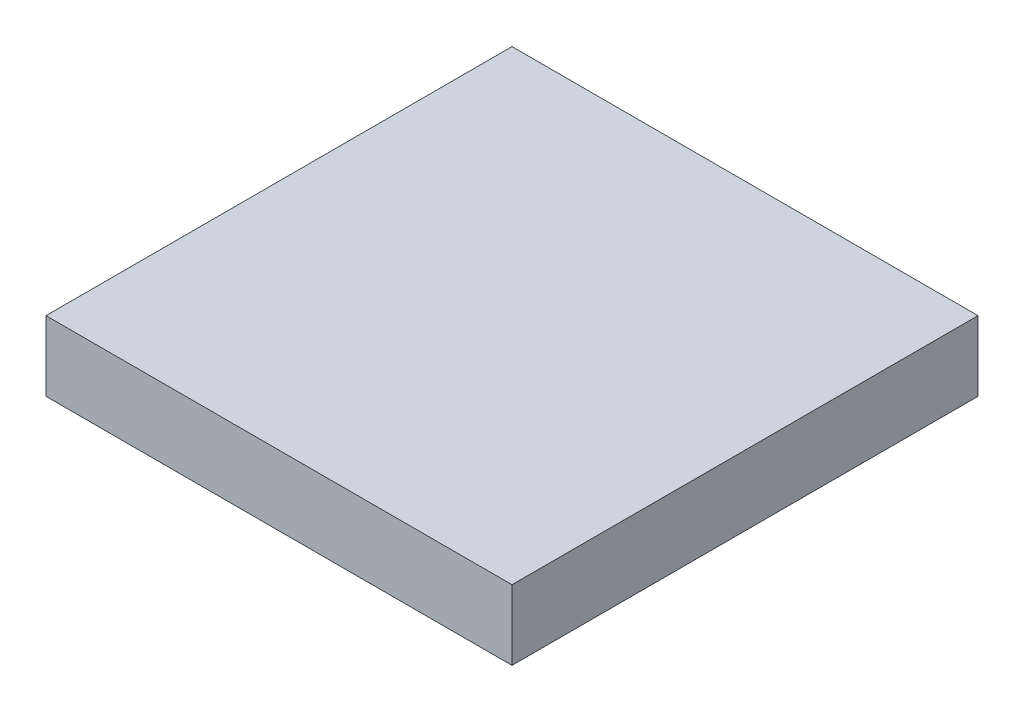
ISO-10303-21;
HEADER;
FILE_DESCRIPTION(('STEP AP214'),'2;1');
FILE_NAME('part.step','',(''),(''),'','','');
FILE_SCHEMA(('AUTOMOTIVE_DESIGN { 1 0 10303 214 1 1 1 1 }'));
ENDSEC;
DATA;
#1=APPLICATION_CONTEXT('core data for automotive mechanical design processes');
#2=APPLICATION_PROTOCOL_DEFINITION('international standard','automotive_design',2000,#1);
#3=PRODUCT_CONTEXT('',#1,'mechanical');
#4=PRODUCT('Part','Part','',(#3));
#5=PRODUCT_RELATED_PRODUCT_CATEGORY('part','',(#4));
#6=PRODUCT_DEFINITION_FORMATION('','',#4);
#7=PRODUCT_DEFINITION_CONTEXT('part definition',#1,'design');
#8=PRODUCT_DEFINITION('design','',#6,#7);
#9=PRODUCT_DEFINITION_SHAPE('','',#8);
#10=(LENGTH_UNIT() NAMED_UNIT(*) SI_UNIT(.MILLI.,.METRE.));
#11=(NAMED_UNIT(*) PLANE_ANGLE_UNIT() SI_UNIT($,.RADIAN.));
#12=(NAMED_UNIT(*) SI_UNIT($,.STERADIAN.) SOLID_ANGLE_UNIT());
#13=UNCERTAINTY_MEASURE_WITH_UNIT(LENGTH_MEASURE(1.E-05),#10,'distance_accuracy_value','');
#14=(GEOMETRIC_REPRESENTATION_CONTEXT(3) GLOBAL_UNCERTAINTY_ASSIGNED_CONTEXT((#13)) GLOBAL_UNIT_ASSIGNED_CONTEXT((#10,
#11,#12)) REPRESENTATION_CONTEXT('',''));
#15=CARTESIAN_POINT('',(0.,0.,0.));
#16=DIRECTION('',(0.,0.,1.));
#17=DIRECTION('',(1.,0.,0.));
#18=AXIS2_PLACEMENT_3D('',#15,#16,#17);
#19=CARTESIAN_POINT('',(0.,15.,0.));
#20=DIRECTION('',(1.,0.,0.));
#21=DIRECTION('',(0.,0.,-1.));
#22=AXIS2_PLACEMENT_3D('',#19,#20,#21);
#23=PLANE('',#22);
#24=DIRECTION('',(0.,0.,1.));
#25=VECTOR('',#24,1.);
#26=CARTESIAN_POINT('',(0.,0.,0.));
#27=LINE('',#26,#25);
#28=CARTESIAN_POINT('',(0.,0.,-100.));
#29=VERTEX_POINT('',#28);
#30=CARTESIAN_POINT('',(0.,0.,0.));
#31=VERTEX_POINT('',#30);
#32=EDGE_CURVE('E107',#29,#31,#27,.T.);
#33=ORIENTED_EDGE('',*,*,#32,.T.);
#34=DIRECTION('',(0.,-1.,0.));
#35=VECTOR('',#34,1.);
#36=CARTESIAN_POINT('',(0.,15.,0.));
#37=LINE('',#36,#35);
#38=CARTESIAN_POINT('',(0.,15.,0.));
#39=VERTEX_POINT('',#38);
#40=EDGE_CURVE('E11',#39,#31,#37,.T.);
#41=ORIENTED_EDGE('',*,*,#40,.F.);
#42=DIRECTION('',(0.,0.,1.));
#43=VECTOR('',#42,1.);
#44=CARTESIAN_POINT('',(0.,15.,0.));
#45=LINE('',#44,#43);
#46=CARTESIAN_POINT('',(0.,15.,-100.));
#47=VERTEX_POINT('',#46);
#48=EDGE_CURVE('E95',#47,#39,#45,.T.);
#49=ORIENTED_EDGE('',*,*,#48,.F.);
#50=DIRECTION('',(0.,-1.,0.));
#51=VECTOR('',#50,1.);
#52=CARTESIAN_POINT('',(0.,15.,-100.));
#53=LINE('',#52,#51);
#54=EDGE_CURVE('E103',#47,#29,#53,.T.);
#55=ORIENTED_EDGE('',*,*,#54,.T.);
#56=EDGE_LOOP('',(#33,#41,#49,#55));
#57=FACE_BOUND('',#56,.T.);
#58=ADVANCED_FACE('F44',(#57),#23,.F.);
#59=CARTESIAN_POINT('',(0.,15.,0.));
#60=DIRECTION('',(0.,0.,-1.));
#61=DIRECTION('',(-1.,0.,0.));
#62=AXIS2_PLACEMENT_3D('',#59,#60,#61);
#63=PLANE('',#62);
#64=DIRECTION('',(1.,0.,0.));
#65=VECTOR('',#64,1.);
#66=CARTESIAN_POINT('',(0.,0.,0.));
#67=LINE('',#66,#65);
#68=CARTESIAN_POINT('',(100.,0.,0.));
#69=VERTEX_POINT('',#68);
#70=EDGE_CURVE('E99',#31,#69,#67,.T.);
#71=ORIENTED_EDGE('',*,*,#70,.T.);
#72=DIRECTION('',(0.,-1.,0.));
#73=VECTOR('',#72,1.);
#74=CARTESIAN_POINT('',(100.,15.,0.));
#75=LINE('',#74,#73);
#76=CARTESIAN_POINT('',(100.,15.,0.));
#77=VERTEX_POINT('',#76);
#78=EDGE_CURVE('E52',#77,#69,#75,.T.);
#79=ORIENTED_EDGE('',*,*,#78,.F.);
#80=DIRECTION('',(1.,0.,0.));
#81=VECTOR('',#80,1.);
#82=CARTESIAN_POINT('',(0.,15.,0.));
#83=LINE('',#82,#81);
#84=EDGE_CURVE('E90',#39,#77,#83,.T.);
#85=ORIENTED_EDGE('',*,*,#84,.F.);
#86=ORIENTED_EDGE('',*,*,#40,.T.);
#87=EDGE_LOOP('',(#71,#79,#85,#86));
#88=FACE_BOUND('',#87,.T.);
#89=ADVANCED_FACE('F98',(#88),#63,.F.);
#90=CARTESIAN_POINT('',(100.,15.,0.));
#91=DIRECTION('',(-1.,0.,0.));
#92=DIRECTION('',(0.,0.,1.));
#93=AXIS2_PLACEMENT_3D('',#90,#91,#92);
#94=PLANE('',#93);
#95=DIRECTION('',(0.,0.,-1.));
#96=VECTOR('',#95,1.);
#97=CARTESIAN_POINT('',(100.,0.,0.));
#98=LINE('',#97,#96);
#99=CARTESIAN_POINT('',(100.,0.,-100.));
#100=VERTEX_POINT('',#99);
#101=EDGE_CURVE('E77',#69,#100,#98,.T.);
#102=ORIENTED_EDGE('',*,*,#101,.T.);
#103=DIRECTION('',(0.,-1.,0.));
#104=VECTOR('',#103,1.);
#105=CARTESIAN_POINT('',(100.,15.,-100.));
#106=LINE('',#105,#104);
#107=CARTESIAN_POINT('',(100.,15.,-100.));
#108=VERTEX_POINT('',#107);
#109=EDGE_CURVE('E100',#108,#100,#106,.T.);
#110=ORIENTED_EDGE('',*,*,#109,.F.);
#111=DIRECTION('',(0.,0.,-1.));
#112=VECTOR('',#111,1.);
#113=CARTESIAN_POINT('',(100.,15.,0.));
#114=LINE('',#113,#112);
#115=EDGE_CURVE('E93',#77,#108,#114,.T.);
#116=ORIENTED_EDGE('',*,*,#115,.F.);
#117=ORIENTED_EDGE('',*,*,#78,.T.);
#118=EDGE_LOOP('',(#102,#110,#116,#117));
#119=FACE_BOUND('',#118,.T.);
#120=ADVANCED_FACE('F101',(#119),#94,.F.);
#121=CARTESIAN_POINT('',(0.,15.,-100.));
#122=DIRECTION('',(0.,0.,1.));
#123=DIRECTION('',(1.,0.,0.));
#124=AXIS2_PLACEMENT_3D('',#121,#122,#123);
#125=PLANE('',#124);
#126=DIRECTION('',(-1.,0.,0.));
#127=VECTOR('',#126,1.);
#128=CARTESIAN_POINT('',(0.,0.,-100.));
#129=LINE('',#128,#127);
#130=EDGE_CURVE('E83',#100,#29,#129,.T.);
#131=ORIENTED_EDGE('',*,*,#130,.T.);
#132=ORIENTED_EDGE('',*,*,#54,.F.);
#133=DIRECTION('',(-1.,0.,0.));
#134=VECTOR('',#133,1.);
#135=CARTESIAN_POINT('',(0.,15.,-100.));
#136=LINE('',#135,#134);
#137=EDGE_CURVE('E60',#108,#47,#136,.T.);
#138=ORIENTED_EDGE('',*,*,#137,.F.);
#139=ORIENTED_EDGE('',*,*,#109,.T.);
#140=EDGE_LOOP('',(#131,#132,#138,#139));
#141=FACE_BOUND('',#140,.T.);
#142=ADVANCED_FACE('F114',(#141),#125,.F.);
#143=CARTESIAN_POINT('',(0.,15.,0.));
#144=DIRECTION('',(0.,-1.,0.));
#145=DIRECTION('',(0.,0.,-1.));
#146=AXIS2_PLACEMENT_3D('',#143,#144,#145);
#147=PLANE('',#146);
#148=ORIENTED_EDGE('',*,*,#48,.T.);
#149=ORIENTED_EDGE('',*,*,#84,.T.);
#150=ORIENTED_EDGE('',*,*,#115,.T.);
#151=ORIENTED_EDGE('',*,*,#137,.T.);
#152=EDGE_LOOP('',(#148,#149,#150,#151));
#153=FACE_BOUND('',#152,.T.);
#154=ADVANCED_FACE('F91',(#153),#147,.F.);
#155=CARTESIAN_POINT('',(0.,0.,0.));
#156=DIRECTION('',(0.,-1.,0.));
#157=DIRECTION('',(0.,0.,-1.));
#158=AXIS2_PLACEMENT_3D('',#155,#156,#157);
#159=PLANE('',#158);
#160=ORIENTED_EDGE('',*,*,#32,.F.);
#161=ORIENTED_EDGE('',*,*,#130,.F.);
#162=ORIENTED_EDGE('',*,*,#101,.F.);
#163=ORIENTED_EDGE('',*,*,#70,.F.);
#164=EDGE_LOOP('',(#160,#161,#162,#163));
#165=FACE_BOUND('',#164,.T.);
#166=ADVANCED_FACE('F117',(#165),#159,.T.);
#167=CLOSED_SHELL('',(#58,#89,#120,#142,#154,#166));
#168=MANIFOLD_SOLID_BREP('B2',#167);
#169=ADVANCED_BREP_SHAPE_REPRESENTATION('',(#18,#168),#14);
#170=SHAPE_DEFINITION_REPRESENTATION(#9,#169);
ENDSEC;
END-ISO-10303-21;
